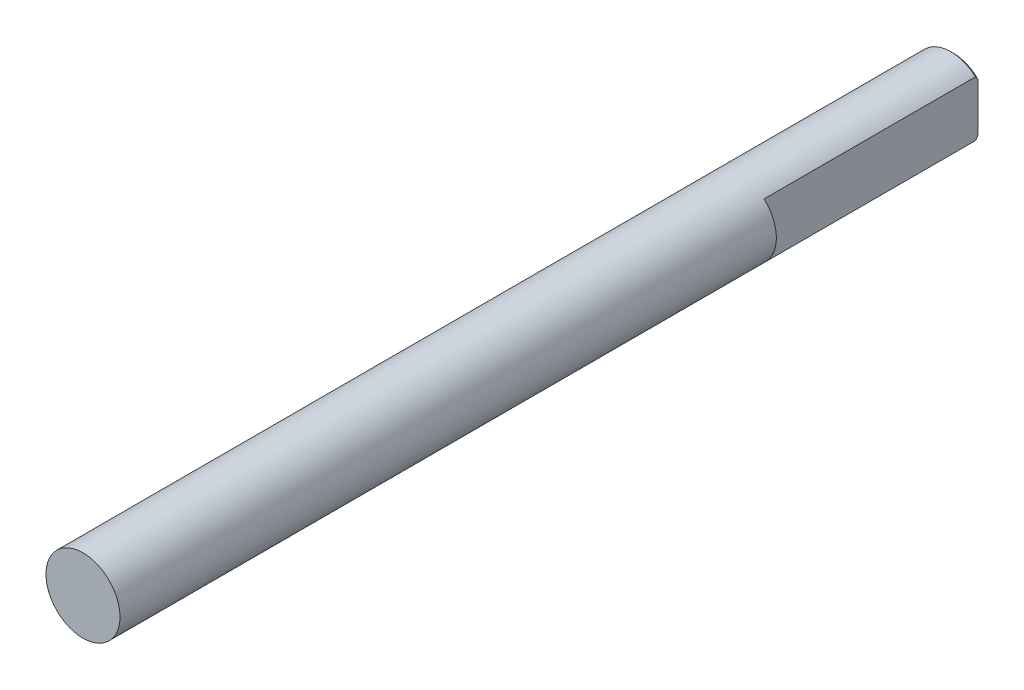
ISO-10303-21;
HEADER;
FILE_DESCRIPTION(('STEP AP214'),'2;1');
FILE_NAME('part.step','',(''),(''),'','','');
FILE_SCHEMA(('AUTOMOTIVE_DESIGN { 1 0 10303 214 1 1 1 1 }'));
ENDSEC;
DATA;
#1=APPLICATION_CONTEXT('core data for automotive mechanical design processes');
#2=APPLICATION_PROTOCOL_DEFINITION('international standard','automotive_design',2000,#1);
#3=PRODUCT_CONTEXT('',#1,'mechanical');
#4=PRODUCT('Part','Part','',(#3));
#5=PRODUCT_RELATED_PRODUCT_CATEGORY('part','',(#4));
#6=PRODUCT_DEFINITION_FORMATION('','',#4);
#7=PRODUCT_DEFINITION_CONTEXT('part definition',#1,'design');
#8=PRODUCT_DEFINITION('design','',#6,#7);
#9=PRODUCT_DEFINITION_SHAPE('','',#8);
#10=(LENGTH_UNIT() NAMED_UNIT(*) SI_UNIT(.MILLI.,.METRE.));
#11=(NAMED_UNIT(*) PLANE_ANGLE_UNIT() SI_UNIT($,.RADIAN.));
#12=(NAMED_UNIT(*) SI_UNIT($,.STERADIAN.) SOLID_ANGLE_UNIT());
#13=UNCERTAINTY_MEASURE_WITH_UNIT(LENGTH_MEASURE(1.E-05),#10,'distance_accuracy_value','');
#14=(GEOMETRIC_REPRESENTATION_CONTEXT(3) GLOBAL_UNCERTAINTY_ASSIGNED_CONTEXT((#13)) GLOBAL_UNIT_ASSIGNED_CONTEXT((#10,
#11,#12)) REPRESENTATION_CONTEXT('',''));
#15=CARTESIAN_POINT('',(0.,0.,0.));
#16=DIRECTION('',(0.,0.,1.));
#17=DIRECTION('',(1.,0.,0.));
#18=AXIS2_PLACEMENT_3D('',#15,#16,#17);
#19=CARTESIAN_POINT('',(0.,0.,26.6));
#20=DIRECTION('',(0.,0.,-1.));
#21=DIRECTION('',(-1.,0.,0.));
#22=AXIS2_PLACEMENT_3D('',#19,#20,#21);
#23=CYLINDRICAL_SURFACE('',#22,1.5);
#24=DIRECTION('',(0.,0.,-1.));
#25=VECTOR('',#24,1.);
#26=CARTESIAN_POINT('',(1.,1.1180339887499,26.6));
#27=LINE('',#26,#25);
#28=CARTESIAN_POINT('',(1.,1.1180339887499,-8.57));
#29=VERTEX_POINT('',#28);
#30=CARTESIAN_POINT('',(1.,1.1180339887499,0.));
#31=VERTEX_POINT('',#30);
#32=EDGE_CURVE('E80',#29,#31,#27,.F.);
#33=ORIENTED_EDGE('',*,*,#32,.F.);
#34=CARTESIAN_POINT('',(0.,0.,-8.57));
#35=DIRECTION('',(0.,0.,-1.));
#36=DIRECTION('',(-1.,0.,0.));
#37=AXIS2_PLACEMENT_3D('',#34,#35,#36);
#38=CIRCLE('',#37,1.5);
#39=CARTESIAN_POINT('',(1.,-1.1180339887499,-8.57));
#40=VERTEX_POINT('',#39);
#41=EDGE_CURVE('E47',#29,#40,#38,.F.);
#42=ORIENTED_EDGE('',*,*,#41,.T.);
#43=DIRECTION('',(0.,0.,-1.));
#44=VECTOR('',#43,1.);
#45=CARTESIAN_POINT('',(1.,-1.1180339887499,26.6));
#46=LINE('',#45,#44);
#47=CARTESIAN_POINT('',(1.,-1.1180339887499,0.));
#48=VERTEX_POINT('',#47);
#49=EDGE_CURVE('E108',#48,#40,#46,.T.);
#50=ORIENTED_EDGE('',*,*,#49,.F.);
#51=CARTESIAN_POINT('',(0.,0.,0.));
#52=DIRECTION('',(0.,0.,-1.));
#53=DIRECTION('',(-1.,0.,0.));
#54=AXIS2_PLACEMENT_3D('',#51,#52,#53);
#55=CIRCLE('',#54,1.5);
#56=EDGE_CURVE('E12',#31,#48,#55,.T.);
#57=ORIENTED_EDGE('',*,*,#56,.F.);
#58=EDGE_LOOP('',(#33,#42,#50,#57));
#59=FACE_BOUND('',#58,.T.);
#60=CARTESIAN_POINT('',(0.,0.,26.6));
#61=DIRECTION('',(0.,0.,1.));
#62=DIRECTION('',(1.,0.,0.));
#63=AXIS2_PLACEMENT_3D('',#60,#61,#62);
#64=CIRCLE('',#63,1.5);
#65=CARTESIAN_POINT('',(1.5,0.,26.6));
#66=VERTEX_POINT('',#65);
#67=EDGE_CURVE('E76',#66,#66,#64,.T.);
#68=ORIENTED_EDGE('',*,*,#67,.F.);
#69=EDGE_LOOP('',(#68));
#70=FACE_BOUND('',#69,.T.);
#71=ADVANCED_FACE('F31',(#59,#70),#23,.T.);
#72=CARTESIAN_POINT('',(0.,0.,-8.67));
#73=DIRECTION('',(0.,0.,-1.));
#74=DIRECTION('',(-1.,0.,0.));
#75=AXIS2_PLACEMENT_3D('',#72,#73,#74);
#76=PLANE('',#75);
#77=CARTESIAN_POINT('',(0.,0.,-8.67));
#78=DIRECTION('',(0.,0.,-1.));
#79=DIRECTION('',(-1.,0.,0.));
#80=AXIS2_PLACEMENT_3D('',#77,#78,#79);
#81=CIRCLE('',#80,1.4);
#82=CARTESIAN_POINT('',(1.,-0.979795897113269,-8.67));
#83=VERTEX_POINT('',#82);
#84=CARTESIAN_POINT('',(1.,0.979795897113269,-8.67));
#85=VERTEX_POINT('',#84);
#86=EDGE_CURVE('E74',#83,#85,#81,.T.);
#87=ORIENTED_EDGE('',*,*,#86,.T.);
#88=DIRECTION('',(0.,-1.,0.));
#89=VECTOR('',#88,1.);
#90=CARTESIAN_POINT('',(1.,1.5,-8.67));
#91=LINE('',#90,#89);
#92=EDGE_CURVE('E66',#85,#83,#91,.T.);
#93=ORIENTED_EDGE('',*,*,#92,.T.);
#94=EDGE_LOOP('',(#87,#93));
#95=FACE_BOUND('',#94,.T.);
#96=ADVANCED_FACE('F75',(#95),#76,.T.);
#97=CARTESIAN_POINT('',(0.,0.,-8.67));
#98=DIRECTION('',(0.,0.,1.));
#99=DIRECTION('',(1.,0.,0.));
#100=AXIS2_PLACEMENT_3D('',#97,#98,#99);
#101=CONICAL_SURFACE('',#100,1.4,0.785398163397444);
#102=ORIENTED_EDGE('',*,*,#41,.F.);
#103=CARTESIAN_POINT('',(1.,3.14609593099418,-6.76880027762356));
#104=CARTESIAN_POINT('',(1.,3.03510449006202,-6.87453848213774));
#105=CARTESIAN_POINT('',(1.,2.92389061981523,-6.98004727804023));
#106=CARTESIAN_POINT('',(1.,2.70071623192757,-7.19034618614613));
#107=CARTESIAN_POINT('',(1.,2.58875547831498,-7.29513604771452));
#108=CARTESIAN_POINT('',(1.,2.36271900425145,-7.50472354172295));
#109=CARTESIAN_POINT('',(1.,2.2486333494718,-7.60951048293517));
#110=CARTESIAN_POINT('',(1.,2.01901353714834,-7.81744273810889));
#111=CARTESIAN_POINT('',(1.,1.90347970465768,-7.92058840907304));
#112=CARTESIAN_POINT('',(1.,1.70650994616919,-8.0924637039229));
#113=CARTESIAN_POINT('',(1.,1.6256836725788,-8.16188920299875));
#114=CARTESIAN_POINT('',(1.,1.46243120805599,-8.29891883320638));
#115=CARTESIAN_POINT('',(1.,1.38000427867944,-8.36652208758799));
#116=CARTESIAN_POINT('',(1.,1.21305248861376,-8.49873463719609));
#117=CARTESIAN_POINT('',(1.,1.12853284218781,-8.56335040992561));
#118=CARTESIAN_POINT('',(1.,0.999190308494363,-8.65666909337472));
#119=CARTESIAN_POINT('',(1.,0.955666051343285,-8.68716354141163));
#120=CARTESIAN_POINT('',(1.,0.867533727053652,-8.74653687589075));
#121=CARTESIAN_POINT('',(1.,0.822925795366342,-8.77541596276601));
#122=CARTESIAN_POINT('',(1.,0.708601886139106,-8.84561477793195));
#123=CARTESIAN_POINT('',(1.,0.637992458011781,-8.88551163116949));
#124=CARTESIAN_POINT('',(1.,0.492631180444378,-8.95703113043089));
#125=CARTESIAN_POINT('',(1.,0.41788658184153,-8.98866773595835));
#126=CARTESIAN_POINT('',(1.,0.282833504990609,-9.03221247801638));
#127=CARTESIAN_POINT('',(1.,0.223513373034296,-9.04706232694641));
#128=CARTESIAN_POINT('',(1.,0.10331190132752,-9.06640996944367));
#129=CARTESIAN_POINT('',(1.,0.0424366943321514,-9.07094351153241));
#130=CARTESIAN_POINT('',(1.,-0.0792153921000876,-9.06871835680802));
#131=CARTESIAN_POINT('',(1.,-0.139991824657249,-9.06193683568007));
#132=CARTESIAN_POINT('',(1.,-0.259712842253645,-9.03851331569182));
#133=CARTESIAN_POINT('',(1.,-0.318650286771953,-9.02183695544012));
#134=CARTESIAN_POINT('',(1.,-0.442103228695598,-8.97837750760258));
#135=CARTESIAN_POINT('',(1.,-0.506215060810877,-8.95049201674106));
#136=CARTESIAN_POINT('',(1.,-0.631451527341551,-8.88857659595868));
#137=CARTESIAN_POINT('',(1.,-0.692569666093706,-8.85453399713611));
#138=CARTESIAN_POINT('',(1.,-0.813228905432291,-8.78198263161217));
#139=CARTESIAN_POINT('',(1.,-0.8727356637446,-8.7434177076267));
#140=CARTESIAN_POINT('',(1.,-0.989820029372198,-8.66361436824385));
#141=CARTESIAN_POINT('',(1.,-1.04739944938853,-8.62237857850129));
#142=CARTESIAN_POINT('',(1.,-1.19982831700636,-8.50941085511403));
#143=CARTESIAN_POINT('',(1.,-1.2934210919243,-8.43599374268241));
#144=CARTESIAN_POINT('',(1.,-1.47817652771559,-8.28614824476908));
#145=CARTESIAN_POINT('',(1.,-1.56933834487285,-8.20971883603647));
#146=CARTESIAN_POINT('',(1.,-1.75016860212726,-8.0548293999048));
#147=CARTESIAN_POINT('',(1.,-1.83983441690642,-7.97636631663372));
#148=CARTESIAN_POINT('',(1.,-2.01801468835769,-7.81817631773982));
#149=CARTESIAN_POINT('',(1.,-2.10652931774603,-7.73844959578195));
#150=CARTESIAN_POINT('',(1.,-2.27503575034748,-7.58510965146708));
#151=CARTESIAN_POINT('',(1.,-2.35509598353578,-7.51157148610611));
#152=CARTESIAN_POINT('',(1.,-2.5147014163966,-7.363931698794));
#153=CARTESIAN_POINT('',(1.,-2.59424659223705,-7.28983005111022));
#154=CARTESIAN_POINT('',(1.,-2.75269104426423,-7.14142734694712));
#155=CARTESIAN_POINT('',(1.,-2.83159155514302,-7.0671276072619));
#156=CARTESIAN_POINT('',(1.,-2.98906697366135,-6.91819403346699));
#157=CARTESIAN_POINT('',(1.,-3.06764190223813,-6.84356022150333));
#158=CARTESIAN_POINT('',(1.,-3.14609593099418,-6.76880027762356));
#159=B_SPLINE_CURVE_WITH_KNOTS('',3,(#103,#104,#105,#106,#107,#108,#109,#110,#111,#112,#113,
#114,#115,#116,#117,#118,#119,#120,#121,#122,#123,#124,#125,#126,#127,#128,#129,#130,#131,#132,
#133,#134,#135,#136,#137,#138,#139,#140,#141,#142,#143,#144,#145,#146,#147,#148,#149,#150,#151,
#152,#153,#154,#155,#156,#157,#158),.UNSPECIFIED.,.F.,.F.,(4,2,2,2,2,2,2,2,2,2,2,2,2,2,2,2,2,2,
2,2,2,2,2,2,2,2,2,4),(0.,0.45989206361345,0.919937046022989,1.38464592255159,1.84925229622923,
2.16888101626098,2.48866087166515,2.80771130692323,2.96711490734053,3.12649868497916,
3.36950912868675,3.61210619626009,3.7948468458576,3.97695328385964,4.15942750431031,
4.34253913481448,4.55177253809203,4.7614414631158,4.97406386945504,5.18648033514846,
5.54321342742883,5.900068761293,6.25749557150879,6.61486812234603,6.94098971097764,
7.26712628318038,7.59225852523172,7.91736952399836),.UNSPECIFIED.);
#160=EDGE_CURVE('E40',#29,#85,#159,.T.);
#161=ORIENTED_EDGE('',*,*,#160,.T.);
#162=ORIENTED_EDGE('',*,*,#86,.F.);
#163=EDGE_CURVE('E68',#83,#40,#159,.T.);
#164=ORIENTED_EDGE('',*,*,#163,.T.);
#165=EDGE_LOOP('',(#102,#161,#162,#164));
#166=FACE_BOUND('',#165,.T.);
#167=ADVANCED_FACE('F33',(#166),#101,.T.);
#168=CARTESIAN_POINT('',(0.,0.,26.6));
#169=DIRECTION('',(0.,0.,1.));
#170=DIRECTION('',(1.,0.,0.));
#171=AXIS2_PLACEMENT_3D('',#168,#169,#170);
#172=PLANE('',#171);
#173=ORIENTED_EDGE('',*,*,#67,.T.);
#174=EDGE_LOOP('',(#173));
#175=FACE_BOUND('',#174,.T.);
#176=ADVANCED_FACE('F94',(#175),#172,.T.);
#177=CARTESIAN_POINT('',(0.,0.,0.));
#178=DIRECTION('',(0.,0.,-1.));
#179=DIRECTION('',(-1.,0.,0.));
#180=AXIS2_PLACEMENT_3D('',#177,#178,#179);
#181=PLANE('',#180);
#182=ORIENTED_EDGE('',*,*,#56,.T.);
#183=DIRECTION('',(0.,-1.,0.));
#184=VECTOR('',#183,1.);
#185=CARTESIAN_POINT('',(1.,1.5,0.));
#186=LINE('',#185,#184);
#187=EDGE_CURVE('E72',#31,#48,#186,.T.);
#188=ORIENTED_EDGE('',*,*,#187,.F.);
#189=EDGE_LOOP('',(#182,#188));
#190=FACE_BOUND('',#189,.T.);
#191=ADVANCED_FACE('F91',(#190),#181,.T.);
#192=CARTESIAN_POINT('',(1.,1.5,0.));
#193=DIRECTION('',(1.,0.,0.));
#194=DIRECTION('',(0.,1.,0.));
#195=AXIS2_PLACEMENT_3D('',#192,#193,#194);
#196=PLANE('',#195);
#197=ORIENTED_EDGE('',*,*,#32,.T.);
#198=ORIENTED_EDGE('',*,*,#187,.T.);
#199=ORIENTED_EDGE('',*,*,#49,.T.);
#200=ORIENTED_EDGE('',*,*,#163,.F.);
#201=ORIENTED_EDGE('',*,*,#92,.F.);
#202=ORIENTED_EDGE('',*,*,#160,.F.);
#203=EDGE_LOOP('',(#197,#198,#199,#200,#201,#202));
#204=FACE_BOUND('',#203,.T.);
#205=ADVANCED_FACE('F67',(#204),#196,.T.);
#206=CLOSED_SHELL('',(#71,#96,#167,#176,#191,#205));
#207=MANIFOLD_SOLID_BREP('B2',#206);
#208=ADVANCED_BREP_SHAPE_REPRESENTATION('',(#18,#207),#14);
#209=SHAPE_DEFINITION_REPRESENTATION(#9,#208);
ENDSEC;
END-ISO-10303-21;
